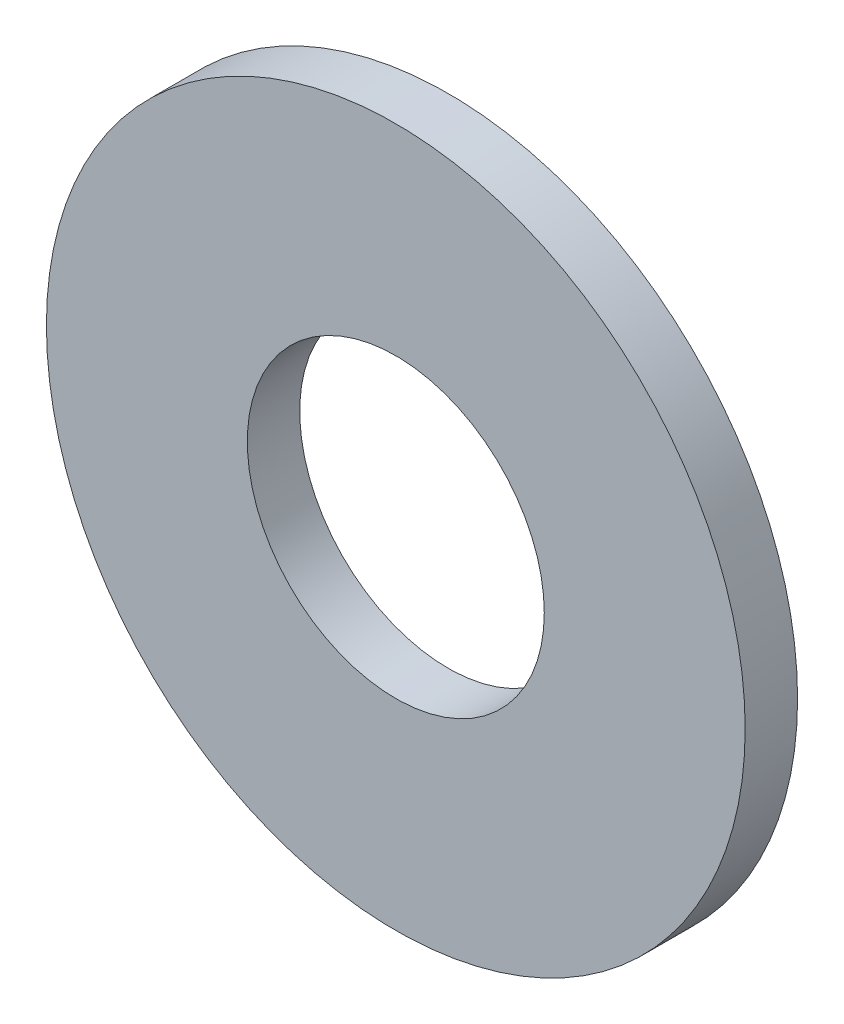
ISO-10303-21;
HEADER;
FILE_DESCRIPTION(('STEP AP214'),'2;1');
FILE_NAME('part.step','',(''),(''),'','','');
FILE_SCHEMA(('AUTOMOTIVE_DESIGN { 1 0 10303 214 1 1 1 1 }'));
ENDSEC;
DATA;
#1=APPLICATION_CONTEXT('core data for automotive mechanical design processes');
#2=APPLICATION_PROTOCOL_DEFINITION('international standard','automotive_design',2000,#1);
#3=PRODUCT_CONTEXT('',#1,'mechanical');
#4=PRODUCT('Part','Part','',(#3));
#5=PRODUCT_RELATED_PRODUCT_CATEGORY('part','',(#4));
#6=PRODUCT_DEFINITION_FORMATION('','',#4);
#7=PRODUCT_DEFINITION_CONTEXT('part definition',#1,'design');
#8=PRODUCT_DEFINITION('design','',#6,#7);
#9=PRODUCT_DEFINITION_SHAPE('','',#8);
#10=(LENGTH_UNIT() NAMED_UNIT(*) SI_UNIT(.MILLI.,.METRE.));
#11=(NAMED_UNIT(*) PLANE_ANGLE_UNIT() SI_UNIT($,.RADIAN.));
#12=(NAMED_UNIT(*) SI_UNIT($,.STERADIAN.) SOLID_ANGLE_UNIT());
#13=UNCERTAINTY_MEASURE_WITH_UNIT(LENGTH_MEASURE(1.E-05),#10,'distance_accuracy_value','');
#14=(GEOMETRIC_REPRESENTATION_CONTEXT(3) GLOBAL_UNCERTAINTY_ASSIGNED_CONTEXT((#13)) GLOBAL_UNIT_ASSIGNED_CONTEXT((#10,
#11,#12)) REPRESENTATION_CONTEXT('',''));
#15=CARTESIAN_POINT('',(0.,0.,0.));
#16=DIRECTION('',(0.,0.,1.));
#17=DIRECTION('',(1.,0.,0.));
#18=AXIS2_PLACEMENT_3D('',#15,#16,#17);
#19=CARTESIAN_POINT('',(0.,0.,0.6));
#20=DIRECTION('',(0.,0.,1.));
#21=DIRECTION('',(1.,0.,0.));
#22=AXIS2_PLACEMENT_3D('',#19,#20,#21);
#23=PLANE('',#22);
#24=CARTESIAN_POINT('',(0.,0.,0.6));
#25=DIRECTION('',(0.,0.,1.));
#26=DIRECTION('',(1.,0.,0.));
#27=AXIS2_PLACEMENT_3D('',#24,#25,#26);
#28=CIRCLE('',#27,4.);
#29=CARTESIAN_POINT('',(4.,0.,0.6));
#30=VERTEX_POINT('',#29);
#31=EDGE_CURVE('E10',#30,#30,#28,.T.);
#32=ORIENTED_EDGE('',*,*,#31,.T.);
#33=EDGE_LOOP('',(#32));
#34=FACE_BOUND('',#33,.T.);
#35=CARTESIAN_POINT('',(0.,0.,0.6));
#36=DIRECTION('',(0.,0.,1.));
#37=DIRECTION('',(1.,0.,0.));
#38=AXIS2_PLACEMENT_3D('',#35,#36,#37);
#39=CIRCLE('',#38,1.7);
#40=CARTESIAN_POINT('',(1.7,0.,0.6));
#41=VERTEX_POINT('',#40);
#42=EDGE_CURVE('E50',#41,#41,#39,.T.);
#43=ORIENTED_EDGE('',*,*,#42,.F.);
#44=EDGE_LOOP('',(#43));
#45=FACE_BOUND('',#44,.T.);
#46=ADVANCED_FACE('F37',(#34,#45),#23,.T.);
#47=CARTESIAN_POINT('',(0.,0.,0.));
#48=DIRECTION('',(0.,0.,1.));
#49=DIRECTION('',(1.,0.,0.));
#50=AXIS2_PLACEMENT_3D('',#47,#48,#49);
#51=PLANE('',#50);
#52=CARTESIAN_POINT('',(0.,0.,0.));
#53=DIRECTION('',(0.,0.,1.));
#54=DIRECTION('',(1.,0.,0.));
#55=AXIS2_PLACEMENT_3D('',#52,#53,#54);
#56=CIRCLE('',#55,4.);
#57=CARTESIAN_POINT('',(4.,0.,0.));
#58=VERTEX_POINT('',#57);
#59=EDGE_CURVE('E41',#58,#58,#56,.T.);
#60=ORIENTED_EDGE('',*,*,#59,.F.);
#61=EDGE_LOOP('',(#60));
#62=FACE_BOUND('',#61,.T.);
#63=CARTESIAN_POINT('',(0.,0.,0.));
#64=DIRECTION('',(0.,0.,1.));
#65=DIRECTION('',(1.,0.,0.));
#66=AXIS2_PLACEMENT_3D('',#63,#64,#65);
#67=CIRCLE('',#66,1.7);
#68=CARTESIAN_POINT('',(1.7,0.,0.));
#69=VERTEX_POINT('',#68);
#70=EDGE_CURVE('E52',#69,#69,#67,.T.);
#71=ORIENTED_EDGE('',*,*,#70,.T.);
#72=EDGE_LOOP('',(#71));
#73=FACE_BOUND('',#72,.T.);
#74=ADVANCED_FACE('F64',(#62,#73),#51,.F.);
#75=CARTESIAN_POINT('',(0.,0.,0.6));
#76=DIRECTION('',(0.,0.,-1.));
#77=DIRECTION('',(-1.,0.,0.));
#78=AXIS2_PLACEMENT_3D('',#75,#76,#77);
#79=CYLINDRICAL_SURFACE('',#78,4.);
#80=ORIENTED_EDGE('',*,*,#31,.F.);
#81=EDGE_LOOP('',(#80));
#82=FACE_BOUND('',#81,.T.);
#83=ORIENTED_EDGE('',*,*,#59,.T.);
#84=EDGE_LOOP('',(#83));
#85=FACE_BOUND('',#84,.T.);
#86=ADVANCED_FACE('F39',(#82,#85),#79,.T.);
#87=CARTESIAN_POINT('',(0.,0.,0.6));
#88=DIRECTION('',(0.,0.,-1.));
#89=DIRECTION('',(-1.,0.,0.));
#90=AXIS2_PLACEMENT_3D('',#87,#88,#89);
#91=CYLINDRICAL_SURFACE('',#90,1.7);
#92=ORIENTED_EDGE('',*,*,#42,.T.);
#93=EDGE_LOOP('',(#92));
#94=FACE_BOUND('',#93,.T.);
#95=ORIENTED_EDGE('',*,*,#70,.F.);
#96=EDGE_LOOP('',(#95));
#97=FACE_BOUND('',#96,.T.);
#98=ADVANCED_FACE('F60',(#94,#97),#91,.F.);
#99=CLOSED_SHELL('',(#46,#74,#86,#98));
#100=MANIFOLD_SOLID_BREP('B2',#99);
#101=ADVANCED_BREP_SHAPE_REPRESENTATION('',(#18,#100),#14);
#102=SHAPE_DEFINITION_REPRESENTATION(#9,#101);
ENDSEC;
END-ISO-10303-21;
